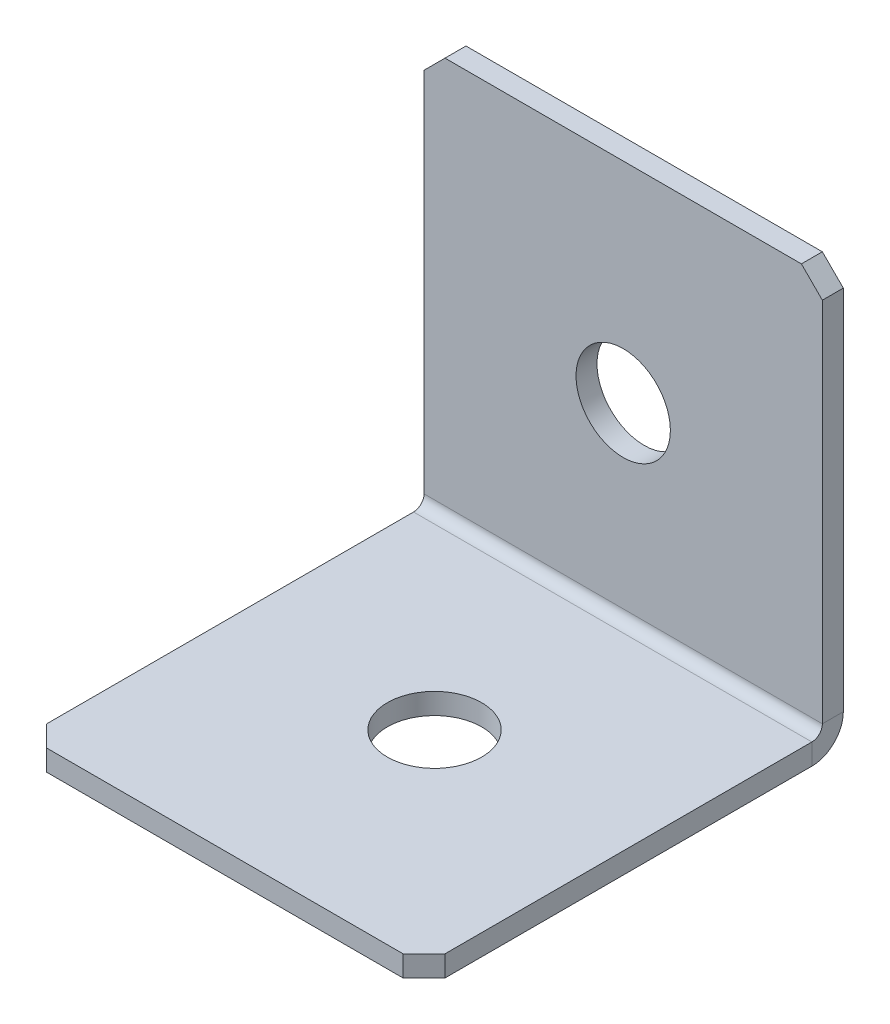
ISO-10303-21;
HEADER;
FILE_DESCRIPTION(('STEP AP214'),'2;1');
FILE_NAME('part.step','',(''),(''),'','','');
FILE_SCHEMA(('AUTOMOTIVE_DESIGN { 1 0 10303 214 1 1 1 1 }'));
ENDSEC;
DATA;
#1=APPLICATION_CONTEXT('core data for automotive mechanical design processes');
#2=APPLICATION_PROTOCOL_DEFINITION('international standard','automotive_design',2000,#1);
#3=PRODUCT_CONTEXT('',#1,'mechanical');
#4=PRODUCT('Part','Part','',(#3));
#5=PRODUCT_RELATED_PRODUCT_CATEGORY('part','',(#4));
#6=PRODUCT_DEFINITION_FORMATION('','',#4);
#7=PRODUCT_DEFINITION_CONTEXT('part definition',#1,'design');
#8=PRODUCT_DEFINITION('design','',#6,#7);
#9=PRODUCT_DEFINITION_SHAPE('','',#8);
#10=(LENGTH_UNIT() NAMED_UNIT(*) SI_UNIT(.MILLI.,.METRE.));
#11=(NAMED_UNIT(*) PLANE_ANGLE_UNIT() SI_UNIT($,.RADIAN.));
#12=(NAMED_UNIT(*) SI_UNIT($,.STERADIAN.) SOLID_ANGLE_UNIT());
#13=UNCERTAINTY_MEASURE_WITH_UNIT(LENGTH_MEASURE(1.E-05),#10,'distance_accuracy_value','');
#14=(GEOMETRIC_REPRESENTATION_CONTEXT(3) GLOBAL_UNCERTAINTY_ASSIGNED_CONTEXT((#13)) GLOBAL_UNIT_ASSIGNED_CONTEXT((#10,
#11,#12)) REPRESENTATION_CONTEXT('',''));
#15=CARTESIAN_POINT('',(0.,0.,0.));
#16=DIRECTION('',(0.,0.,1.));
#17=DIRECTION('',(1.,0.,0.));
#18=AXIS2_PLACEMENT_3D('',#15,#16,#17);
#19=CARTESIAN_POINT('',(19.,0.,2.));
#20=DIRECTION('',(-1.,0.,0.));
#21=DIRECTION('',(0.,1.,0.));
#22=AXIS2_PLACEMENT_3D('',#19,#20,#21);
#23=PLANE('',#22);
#24=DIRECTION('',(0.,1.,0.));
#25=VECTOR('',#24,1.);
#26=CARTESIAN_POINT('',(19.,0.,0.));
#27=LINE('',#26,#25);
#28=CARTESIAN_POINT('',(19.,3.,0.));
#29=VERTEX_POINT('',#28);
#30=CARTESIAN_POINT('',(19.,38.,0.));
#31=VERTEX_POINT('',#30);
#32=EDGE_CURVE('E233',#29,#31,#27,.T.);
#33=ORIENTED_EDGE('',*,*,#32,.T.);
#34=DIRECTION('',(0.,0.,-1.));
#35=VECTOR('',#34,1.);
#36=CARTESIAN_POINT('',(19.,38.,2.));
#37=LINE('',#36,#35);
#38=CARTESIAN_POINT('',(19.,38.,2.));
#39=VERTEX_POINT('',#38);
#40=EDGE_CURVE('E253',#31,#39,#37,.F.);
#41=ORIENTED_EDGE('',*,*,#40,.T.);
#42=DIRECTION('',(0.,1.,0.));
#43=VECTOR('',#42,1.);
#44=CARTESIAN_POINT('',(19.,0.,2.));
#45=LINE('',#44,#43);
#46=CARTESIAN_POINT('',(19.,3.,2.));
#47=VERTEX_POINT('',#46);
#48=EDGE_CURVE('E224',#47,#39,#45,.T.);
#49=ORIENTED_EDGE('',*,*,#48,.F.);
#50=DIRECTION('',(0.,0.,-1.));
#51=VECTOR('',#50,1.);
#52=CARTESIAN_POINT('',(19.,3.,2.));
#53=LINE('',#52,#51);
#54=EDGE_CURVE('E209',#47,#29,#53,.T.);
#55=ORIENTED_EDGE('',*,*,#54,.T.);
#56=EDGE_LOOP('',(#33,#41,#49,#55));
#57=FACE_BOUND('',#56,.T.);
#58=ADVANCED_FACE('F62',(#57),#23,.F.);
#59=CARTESIAN_POINT('',(0.,0.,2.));
#60=DIRECTION('',(0.,0.,-1.));
#61=DIRECTION('',(-1.,0.,0.));
#62=AXIS2_PLACEMENT_3D('',#59,#60,#61);
#63=PLANE('',#62);
#64=CARTESIAN_POINT('',(0.,20.,2.));
#65=DIRECTION('',(0.,0.,1.));
#66=DIRECTION('',(1.,0.,0.));
#67=AXIS2_PLACEMENT_3D('',#64,#65,#66);
#68=CIRCLE('',#67,4.5);
#69=CARTESIAN_POINT('',(4.5,20.,2.));
#70=VERTEX_POINT('',#69);
#71=EDGE_CURVE('E516',#70,#70,#68,.T.);
#72=ORIENTED_EDGE('',*,*,#71,.F.);
#73=EDGE_LOOP('',(#72));
#74=FACE_BOUND('',#73,.T.);
#75=ORIENTED_EDGE('',*,*,#48,.T.);
#76=DIRECTION('',(0.707106781186549,-0.707106781186546,0.));
#77=VECTOR('',#76,1.);
#78=CARTESIAN_POINT('',(19.,38.,2.));
#79=LINE('',#78,#77);
#80=CARTESIAN_POINT('',(17.,40.,2.));
#81=VERTEX_POINT('',#80);
#82=EDGE_CURVE('E258',#39,#81,#79,.F.);
#83=ORIENTED_EDGE('',*,*,#82,.T.);
#84=DIRECTION('',(-1.,0.,0.));
#85=VECTOR('',#84,1.);
#86=CARTESIAN_POINT('',(-19.,40.,2.));
#87=LINE('',#86,#85);
#88=CARTESIAN_POINT('',(-17.,40.,2.));
#89=VERTEX_POINT('',#88);
#90=EDGE_CURVE('E228',#81,#89,#87,.T.);
#91=ORIENTED_EDGE('',*,*,#90,.T.);
#92=DIRECTION('',(0.707106781186546,0.707106781186549,0.));
#93=VECTOR('',#92,1.);
#94=CARTESIAN_POINT('',(-17.,40.,2.));
#95=LINE('',#94,#93);
#96=CARTESIAN_POINT('',(-19.,38.,2.));
#97=VERTEX_POINT('',#96);
#98=EDGE_CURVE('E256',#89,#97,#95,.F.);
#99=ORIENTED_EDGE('',*,*,#98,.T.);
#100=DIRECTION('',(0.,-1.,0.));
#101=VECTOR('',#100,1.);
#102=CARTESIAN_POINT('',(-19.,0.,2.));
#103=LINE('',#102,#101);
#104=CARTESIAN_POINT('',(-19.,3.,2.));
#105=VERTEX_POINT('',#104);
#106=EDGE_CURVE('E222',#97,#105,#103,.T.);
#107=ORIENTED_EDGE('',*,*,#106,.T.);
#108=DIRECTION('',(1.,0.,0.));
#109=VECTOR('',#108,1.);
#110=CARTESIAN_POINT('',(19.,3.,2.));
#111=LINE('',#110,#109);
#112=EDGE_CURVE('E213',#47,#105,#111,.F.);
#113=ORIENTED_EDGE('',*,*,#112,.F.);
#114=EDGE_LOOP('',(#75,#83,#91,#99,#107,#113));
#115=FACE_BOUND('',#114,.T.);
#116=ADVANCED_FACE('F276',(#74,#115),#63,.F.);
#117=CARTESIAN_POINT('',(0.,0.,0.));
#118=DIRECTION('',(0.,0.,-1.));
#119=DIRECTION('',(-1.,0.,0.));
#120=AXIS2_PLACEMENT_3D('',#117,#118,#119);
#121=PLANE('',#120);
#122=CARTESIAN_POINT('',(0.,20.,0.));
#123=DIRECTION('',(0.,0.,-1.));
#124=DIRECTION('',(-1.,0.,0.));
#125=AXIS2_PLACEMENT_3D('',#122,#123,#124);
#126=CIRCLE('',#125,4.5);
#127=CARTESIAN_POINT('',(-4.5,20.,0.));
#128=VERTEX_POINT('',#127);
#129=EDGE_CURVE('E206',#128,#128,#126,.T.);
#130=ORIENTED_EDGE('',*,*,#129,.F.);
#131=EDGE_LOOP('',(#130));
#132=FACE_BOUND('',#131,.T.);
#133=DIRECTION('',(-1.,0.,0.));
#134=VECTOR('',#133,1.);
#135=CARTESIAN_POINT('',(0.,40.,0.));
#136=LINE('',#135,#134);
#137=CARTESIAN_POINT('',(17.,40.,0.));
#138=VERTEX_POINT('',#137);
#139=CARTESIAN_POINT('',(-17.,40.,0.));
#140=VERTEX_POINT('',#139);
#141=EDGE_CURVE('E225',#138,#140,#136,.T.);
#142=ORIENTED_EDGE('',*,*,#141,.F.);
#143=DIRECTION('',(-0.707106781186549,0.707106781186546,0.));
#144=VECTOR('',#143,1.);
#145=CARTESIAN_POINT('',(28.5,28.5000000000001,0.));
#146=LINE('',#145,#144);
#147=EDGE_CURVE('E71',#138,#31,#146,.F.);
#148=ORIENTED_EDGE('',*,*,#147,.T.);
#149=ORIENTED_EDGE('',*,*,#32,.F.);
#150=DIRECTION('',(1.,0.,0.));
#151=VECTOR('',#150,1.);
#152=CARTESIAN_POINT('',(19.,3.,0.));
#153=LINE('',#152,#151);
#154=CARTESIAN_POINT('',(-19.,3.00000000000001,0.));
#155=VERTEX_POINT('',#154);
#156=EDGE_CURVE('E160',#29,#155,#153,.F.);
#157=ORIENTED_EDGE('',*,*,#156,.T.);
#158=DIRECTION('',(0.,1.,0.));
#159=VECTOR('',#158,1.);
#160=CARTESIAN_POINT('',(-19.,0.,0.));
#161=LINE('',#160,#159);
#162=CARTESIAN_POINT('',(-19.,38.,0.));
#163=VERTEX_POINT('',#162);
#164=EDGE_CURVE('E220',#163,#155,#161,.F.);
#165=ORIENTED_EDGE('',*,*,#164,.F.);
#166=DIRECTION('',(-0.707106781186546,-0.707106781186549,0.));
#167=VECTOR('',#166,1.);
#168=CARTESIAN_POINT('',(-28.5,28.4999999999999,0.));
#169=LINE('',#168,#167);
#170=EDGE_CURVE('E83',#163,#140,#169,.F.);
#171=ORIENTED_EDGE('',*,*,#170,.T.);
#172=EDGE_LOOP('',(#142,#148,#149,#157,#165,#171));
#173=FACE_BOUND('',#172,.T.);
#174=ADVANCED_FACE('F267',(#132,#173),#121,.T.);
#175=CARTESIAN_POINT('',(-19.,40.,2.));
#176=DIRECTION('',(0.,-1.,0.));
#177=DIRECTION('',(-1.,0.,0.));
#178=AXIS2_PLACEMENT_3D('',#175,#176,#177);
#179=PLANE('',#178);
#180=ORIENTED_EDGE('',*,*,#90,.F.);
#181=DIRECTION('',(0.,0.,1.));
#182=VECTOR('',#181,1.);
#183=CARTESIAN_POINT('',(17.,40.,2.));
#184=LINE('',#183,#182);
#185=EDGE_CURVE('E263',#81,#138,#184,.F.);
#186=ORIENTED_EDGE('',*,*,#185,.T.);
#187=ORIENTED_EDGE('',*,*,#141,.T.);
#188=DIRECTION('',(0.,0.,-1.));
#189=VECTOR('',#188,1.);
#190=CARTESIAN_POINT('',(-17.,40.,2.));
#191=LINE('',#190,#189);
#192=EDGE_CURVE('E260',#140,#89,#191,.F.);
#193=ORIENTED_EDGE('',*,*,#192,.T.);
#194=EDGE_LOOP('',(#180,#186,#187,#193));
#195=FACE_BOUND('',#194,.T.);
#196=ADVANCED_FACE('F279',(#195),#179,.F.);
#197=CARTESIAN_POINT('',(-19.,0.,2.));
#198=DIRECTION('',(1.,0.,0.));
#199=DIRECTION('',(0.,-1.,0.));
#200=AXIS2_PLACEMENT_3D('',#197,#198,#199);
#201=PLANE('',#200);
#202=ORIENTED_EDGE('',*,*,#106,.F.);
#203=DIRECTION('',(0.,0.,1.));
#204=VECTOR('',#203,1.);
#205=CARTESIAN_POINT('',(-19.,38.,2.));
#206=LINE('',#205,#204);
#207=EDGE_CURVE('E13',#97,#163,#206,.F.);
#208=ORIENTED_EDGE('',*,*,#207,.T.);
#209=ORIENTED_EDGE('',*,*,#164,.T.);
#210=DIRECTION('',(0.,0.,-1.));
#211=VECTOR('',#210,1.);
#212=CARTESIAN_POINT('',(-19.,3.,2.));
#213=LINE('',#212,#211);
#214=EDGE_CURVE('E217',#105,#155,#213,.T.);
#215=ORIENTED_EDGE('',*,*,#214,.F.);
#216=EDGE_LOOP('',(#202,#208,#209,#215));
#217=FACE_BOUND('',#216,.T.);
#218=ADVANCED_FACE('F283',(#217),#201,.F.);
#219=CARTESIAN_POINT('',(-19.,3.,3.));
#220=DIRECTION('',(-1.,0.,0.));
#221=DIRECTION('',(0.,0.,1.));
#222=AXIS2_PLACEMENT_3D('',#219,#220,#221);
#223=PLANE('',#222);
#224=DIRECTION('',(0.,1.,0.));
#225=VECTOR('',#224,1.);
#226=CARTESIAN_POINT('',(-19.,0.,2.99999999999999));
#227=LINE('',#226,#225);
#228=CARTESIAN_POINT('',(-19.,2.,3.));
#229=VERTEX_POINT('',#228);
#230=CARTESIAN_POINT('',(-19.,0.,2.99999999999999));
#231=VERTEX_POINT('',#230);
#232=EDGE_CURVE('E203',#229,#231,#227,.F.);
#233=ORIENTED_EDGE('',*,*,#232,.F.);
#234=CARTESIAN_POINT('',(-19.,3.,3.));
#235=DIRECTION('',(1.,0.,0.));
#236=DIRECTION('',(0.,0.,-1.));
#237=AXIS2_PLACEMENT_3D('',#234,#235,#236);
#238=CIRCLE('',#237,1.);
#239=EDGE_CURVE('E163',#105,#229,#238,.F.);
#240=ORIENTED_EDGE('',*,*,#239,.F.);
#241=ORIENTED_EDGE('',*,*,#214,.T.);
#242=CARTESIAN_POINT('',(-19.,3.,3.));
#243=DIRECTION('',(1.,0.,0.));
#244=DIRECTION('',(0.,0.,-1.));
#245=AXIS2_PLACEMENT_3D('',#242,#243,#244);
#246=CIRCLE('',#245,3.);
#247=EDGE_CURVE('E208',#155,#231,#246,.F.);
#248=ORIENTED_EDGE('',*,*,#247,.T.);
#249=EDGE_LOOP('',(#233,#240,#241,#248));
#250=FACE_BOUND('',#249,.T.);
#251=ADVANCED_FACE('F287',(#250),#223,.T.);
#252=CARTESIAN_POINT('',(19.,3.,3.));
#253=DIRECTION('',(-1.,0.,0.));
#254=DIRECTION('',(0.,0.,1.));
#255=AXIS2_PLACEMENT_3D('',#252,#253,#254);
#256=PLANE('',#255);
#257=CARTESIAN_POINT('',(19.,3.,3.));
#258=DIRECTION('',(1.,0.,0.));
#259=DIRECTION('',(0.,0.,-1.));
#260=AXIS2_PLACEMENT_3D('',#257,#258,#259);
#261=CIRCLE('',#260,1.);
#262=CARTESIAN_POINT('',(19.,2.,3.));
#263=VERTEX_POINT('',#262);
#264=EDGE_CURVE('E170',#263,#47,#261,.T.);
#265=ORIENTED_EDGE('',*,*,#264,.F.);
#266=DIRECTION('',(0.,1.,0.));
#267=VECTOR('',#266,1.);
#268=CARTESIAN_POINT('',(19.,2.,3.));
#269=LINE('',#268,#267);
#270=CARTESIAN_POINT('',(19.,0.,2.99999999999999));
#271=VERTEX_POINT('',#270);
#272=EDGE_CURVE('E167',#263,#271,#269,.F.);
#273=ORIENTED_EDGE('',*,*,#272,.T.);
#274=CARTESIAN_POINT('',(19.,3.,3.));
#275=DIRECTION('',(1.,0.,0.));
#276=DIRECTION('',(0.,0.,-1.));
#277=AXIS2_PLACEMENT_3D('',#274,#275,#276);
#278=CIRCLE('',#277,3.);
#279=EDGE_CURVE('E152',#271,#29,#278,.T.);
#280=ORIENTED_EDGE('',*,*,#279,.T.);
#281=ORIENTED_EDGE('',*,*,#54,.F.);
#282=EDGE_LOOP('',(#265,#273,#280,#281));
#283=FACE_BOUND('',#282,.T.);
#284=ADVANCED_FACE('F168',(#283),#256,.F.);
#285=CARTESIAN_POINT('',(19.,3.,3.));
#286=DIRECTION('',(1.,0.,0.));
#287=DIRECTION('',(0.,-1.,0.));
#288=AXIS2_PLACEMENT_3D('',#285,#286,#287);
#289=CYLINDRICAL_SURFACE('',#288,3.);
#290=ORIENTED_EDGE('',*,*,#156,.F.);
#291=ORIENTED_EDGE('',*,*,#279,.F.);
#292=DIRECTION('',(1.,0.,0.));
#293=VECTOR('',#292,1.);
#294=CARTESIAN_POINT('',(-19.,0.,2.99999999999999));
#295=LINE('',#294,#293);
#296=EDGE_CURVE('E157',#271,#231,#295,.F.);
#297=ORIENTED_EDGE('',*,*,#296,.T.);
#298=ORIENTED_EDGE('',*,*,#247,.F.);
#299=EDGE_LOOP('',(#290,#291,#297,#298));
#300=FACE_BOUND('',#299,.T.);
#301=ADVANCED_FACE('F154',(#300),#289,.T.);
#302=CARTESIAN_POINT('',(19.,3.,3.));
#303=DIRECTION('',(1.,0.,0.));
#304=DIRECTION('',(0.,-1.,0.));
#305=AXIS2_PLACEMENT_3D('',#302,#303,#304);
#306=CYLINDRICAL_SURFACE('',#305,1.);
#307=ORIENTED_EDGE('',*,*,#112,.T.);
#308=ORIENTED_EDGE('',*,*,#239,.T.);
#309=DIRECTION('',(1.,0.,0.));
#310=VECTOR('',#309,1.);
#311=CARTESIAN_POINT('',(-19.,2.,3.));
#312=LINE('',#311,#310);
#313=EDGE_CURVE('E175',#229,#263,#312,.T.);
#314=ORIENTED_EDGE('',*,*,#313,.T.);
#315=ORIENTED_EDGE('',*,*,#264,.T.);
#316=EDGE_LOOP('',(#307,#308,#314,#315));
#317=FACE_BOUND('',#316,.T.);
#318=ADVANCED_FACE('F290',(#317),#306,.F.);
#319=CARTESIAN_POINT('',(-19.,0.,1.99999999999999));
#320=DIRECTION('',(1.,0.,0.));
#321=DIRECTION('',(0.,0.,-1.));
#322=AXIS2_PLACEMENT_3D('',#319,#320,#321);
#323=PLANE('',#322);
#324=DIRECTION('',(0.,0.,-1.));
#325=VECTOR('',#324,1.);
#326=CARTESIAN_POINT('',(-19.,0.,0.));
#327=LINE('',#326,#325);
#328=CARTESIAN_POINT('',(-19.,-1.25737396972132E-13,38.));
#329=VERTEX_POINT('',#328);
#330=EDGE_CURVE('E183',#329,#231,#327,.T.);
#331=ORIENTED_EDGE('',*,*,#330,.F.);
#332=DIRECTION('',(0.,1.,0.));
#333=VECTOR('',#332,1.);
#334=CARTESIAN_POINT('',(-19.,-1.25693328198353E-13,38.));
#335=LINE('',#334,#333);
#336=CARTESIAN_POINT('',(-19.,1.99999999999987,38.));
#337=VERTEX_POINT('',#336);
#338=EDGE_CURVE('E250',#329,#337,#335,.T.);
#339=ORIENTED_EDGE('',*,*,#338,.T.);
#340=DIRECTION('',(0.,0.,1.));
#341=VECTOR('',#340,1.);
#342=CARTESIAN_POINT('',(-19.,2.,2.));
#343=LINE('',#342,#341);
#344=EDGE_CURVE('E184',#337,#229,#343,.F.);
#345=ORIENTED_EDGE('',*,*,#344,.T.);
#346=ORIENTED_EDGE('',*,*,#232,.T.);
#347=EDGE_LOOP('',(#331,#339,#345,#346));
#348=FACE_BOUND('',#347,.T.);
#349=ADVANCED_FACE('F307',(#348),#323,.F.);
#350=CARTESIAN_POINT('',(19.,-1.32706345912226E-13,40.));
#351=DIRECTION('',(-1.,0.,0.));
#352=DIRECTION('',(0.,0.,1.));
#353=AXIS2_PLACEMENT_3D('',#350,#351,#352);
#354=PLANE('',#353);
#355=DIRECTION('',(0.,0.,-1.));
#356=VECTOR('',#355,1.);
#357=CARTESIAN_POINT('',(19.,1.99999999999987,40.));
#358=LINE('',#357,#356);
#359=CARTESIAN_POINT('',(19.,1.99999999999987,38.));
#360=VERTEX_POINT('',#359);
#361=EDGE_CURVE('E199',#263,#360,#358,.F.);
#362=ORIENTED_EDGE('',*,*,#361,.T.);
#363=DIRECTION('',(0.,-1.,0.));
#364=VECTOR('',#363,1.);
#365=CARTESIAN_POINT('',(19.,-1.25723383234539E-13,38.));
#366=LINE('',#365,#364);
#367=CARTESIAN_POINT('',(19.,-1.25737396972132E-13,38.));
#368=VERTEX_POINT('',#367);
#369=EDGE_CURVE('E188',#360,#368,#366,.T.);
#370=ORIENTED_EDGE('',*,*,#369,.T.);
#371=DIRECTION('',(0.,0.,1.));
#372=VECTOR('',#371,1.);
#373=CARTESIAN_POINT('',(19.,0.,0.));
#374=LINE('',#373,#372);
#375=EDGE_CURVE('E180',#271,#368,#374,.T.);
#376=ORIENTED_EDGE('',*,*,#375,.F.);
#377=ORIENTED_EDGE('',*,*,#272,.F.);
#378=EDGE_LOOP('',(#362,#370,#376,#377));
#379=FACE_BOUND('',#378,.T.);
#380=ADVANCED_FACE('F186',(#379),#354,.F.);
#381=CARTESIAN_POINT('',(0.,0.,0.));
#382=DIRECTION('',(0.,1.,0.));
#383=DIRECTION('',(0.,0.,1.));
#384=AXIS2_PLACEMENT_3D('',#381,#382,#383);
#385=PLANE('',#384);
#386=CARTESIAN_POINT('',(0.,0.,20.));
#387=DIRECTION('',(0.,1.,0.));
#388=DIRECTION('',(0.,0.,1.));
#389=AXIS2_PLACEMENT_3D('',#386,#387,#388);
#390=CIRCLE('',#389,4.5);
#391=CARTESIAN_POINT('',(0.,0.,24.5));
#392=VERTEX_POINT('',#391);
#393=EDGE_CURVE('E519',#392,#392,#390,.T.);
#394=ORIENTED_EDGE('',*,*,#393,.T.);
#395=EDGE_LOOP('',(#394));
#396=FACE_BOUND('',#395,.T.);
#397=ORIENTED_EDGE('',*,*,#375,.T.);
#398=DIRECTION('',(0.707106781186547,0.,-0.707106781186548));
#399=VECTOR('',#398,1.);
#400=CARTESIAN_POINT('',(17.,-1.32706345912226E-13,40.));
#401=LINE('',#400,#399);
#402=CARTESIAN_POINT('',(17.,-1.32720359649818E-13,40.));
#403=VERTEX_POINT('',#402);
#404=EDGE_CURVE('E248',#368,#403,#401,.F.);
#405=ORIENTED_EDGE('',*,*,#404,.T.);
#406=DIRECTION('',(-1.,0.,0.));
#407=VECTOR('',#406,1.);
#408=CARTESIAN_POINT('',(0.,-1.32720359649818E-13,40.));
#409=LINE('',#408,#407);
#410=CARTESIAN_POINT('',(-17.,-1.32720359649818E-13,40.));
#411=VERTEX_POINT('',#410);
#412=EDGE_CURVE('E189',#403,#411,#409,.T.);
#413=ORIENTED_EDGE('',*,*,#412,.T.);
#414=DIRECTION('',(0.70710678118655,0.,0.707106781186545));
#415=VECTOR('',#414,1.);
#416=CARTESIAN_POINT('',(-19.,-1.25693328198353E-13,38.));
#417=LINE('',#416,#415);
#418=EDGE_CURVE('E246',#411,#329,#417,.F.);
#419=ORIENTED_EDGE('',*,*,#418,.T.);
#420=ORIENTED_EDGE('',*,*,#330,.T.);
#421=ORIENTED_EDGE('',*,*,#296,.F.);
#422=EDGE_LOOP('',(#397,#405,#413,#419,#420,#421));
#423=FACE_BOUND('',#422,.T.);
#424=ADVANCED_FACE('F179',(#396,#423),#385,.F.);
#425=CARTESIAN_POINT('',(0.,2.00000000000001,0.));
#426=DIRECTION('',(0.,1.,0.));
#427=DIRECTION('',(0.,0.,1.));
#428=AXIS2_PLACEMENT_3D('',#425,#426,#427);
#429=PLANE('',#428);
#430=CARTESIAN_POINT('',(0.,1.99999999999994,20.));
#431=DIRECTION('',(0.,1.,0.));
#432=DIRECTION('',(0.,0.,1.));
#433=AXIS2_PLACEMENT_3D('',#430,#431,#432);
#434=CIRCLE('',#433,4.5);
#435=CARTESIAN_POINT('',(0.,1.99999999999992,24.5));
#436=VERTEX_POINT('',#435);
#437=EDGE_CURVE('E524',#436,#436,#434,.T.);
#438=ORIENTED_EDGE('',*,*,#437,.F.);
#439=EDGE_LOOP('',(#438));
#440=FACE_BOUND('',#439,.T.);
#441=DIRECTION('',(1.,0.,0.));
#442=VECTOR('',#441,1.);
#443=CARTESIAN_POINT('',(-19.,1.99999999999987,40.));
#444=LINE('',#443,#442);
#445=CARTESIAN_POINT('',(17.,1.99999999999987,40.));
#446=VERTEX_POINT('',#445);
#447=CARTESIAN_POINT('',(-17.,1.99999999999987,40.));
#448=VERTEX_POINT('',#447);
#449=EDGE_CURVE('E193',#446,#448,#444,.F.);
#450=ORIENTED_EDGE('',*,*,#449,.F.);
#451=DIRECTION('',(-0.707106781186547,0.,0.707106781186548));
#452=VECTOR('',#451,1.);
#453=CARTESIAN_POINT('',(28.5,1.99999999999991,28.5));
#454=LINE('',#453,#452);
#455=EDGE_CURVE('E243',#446,#360,#454,.F.);
#456=ORIENTED_EDGE('',*,*,#455,.T.);
#457=ORIENTED_EDGE('',*,*,#361,.F.);
#458=ORIENTED_EDGE('',*,*,#313,.F.);
#459=ORIENTED_EDGE('',*,*,#344,.F.);
#460=DIRECTION('',(-0.70710678118655,0.,-0.707106781186545));
#461=VECTOR('',#460,1.);
#462=CARTESIAN_POINT('',(-28.4999999999999,1.99999999999991,28.5000000000001));
#463=LINE('',#462,#461);
#464=EDGE_CURVE('E241',#337,#448,#463,.F.);
#465=ORIENTED_EDGE('',*,*,#464,.T.);
#466=EDGE_LOOP('',(#450,#456,#457,#458,#459,#465));
#467=FACE_BOUND('',#466,.T.);
#468=ADVANCED_FACE('F294',(#440,#467),#429,.T.);
#469=CARTESIAN_POINT('',(-19.,-1.32706345912226E-13,40.));
#470=DIRECTION('',(0.,0.,-1.));
#471=DIRECTION('',(0.,1.,0.));
#472=AXIS2_PLACEMENT_3D('',#469,#470,#471);
#473=PLANE('',#472);
#474=ORIENTED_EDGE('',*,*,#412,.F.);
#475=DIRECTION('',(0.,1.,0.));
#476=VECTOR('',#475,1.);
#477=CARTESIAN_POINT('',(17.,-1.32706345912226E-13,40.));
#478=LINE('',#477,#476);
#479=EDGE_CURVE('E238',#403,#446,#478,.T.);
#480=ORIENTED_EDGE('',*,*,#479,.T.);
#481=ORIENTED_EDGE('',*,*,#449,.T.);
#482=DIRECTION('',(0.,-1.,0.));
#483=VECTOR('',#482,1.);
#484=CARTESIAN_POINT('',(-17.,-1.32706345912226E-13,40.));
#485=LINE('',#484,#483);
#486=EDGE_CURVE('E231',#448,#411,#485,.T.);
#487=ORIENTED_EDGE('',*,*,#486,.T.);
#488=EDGE_LOOP('',(#474,#480,#481,#487));
#489=FACE_BOUND('',#488,.T.);
#490=ADVANCED_FACE('F301',(#489),#473,.F.);
#491=CARTESIAN_POINT('',(0.,20.,2.));
#492=DIRECTION('',(0.,0.,1.));
#493=DIRECTION('',(1.,0.,0.));
#494=AXIS2_PLACEMENT_3D('',#491,#492,#493);
#495=CYLINDRICAL_SURFACE('',#494,4.5);
#496=ORIENTED_EDGE('',*,*,#71,.T.);
#497=EDGE_LOOP('',(#496));
#498=FACE_BOUND('',#497,.T.);
#499=ORIENTED_EDGE('',*,*,#129,.T.);
#500=EDGE_LOOP('',(#499));
#501=FACE_BOUND('',#500,.T.);
#502=ADVANCED_FACE('F373',(#498,#501),#495,.F.);
#503=CARTESIAN_POINT('',(0.,1.99999999999994,20.));
#504=DIRECTION('',(0.,1.,0.));
#505=DIRECTION('',(0.,0.,1.));
#506=AXIS2_PLACEMENT_3D('',#503,#504,#505);
#507=CYLINDRICAL_SURFACE('',#506,4.5);
#508=ORIENTED_EDGE('',*,*,#393,.F.);
#509=EDGE_LOOP('',(#508));
#510=FACE_BOUND('',#509,.T.);
#511=ORIENTED_EDGE('',*,*,#437,.T.);
#512=EDGE_LOOP('',(#511));
#513=FACE_BOUND('',#512,.T.);
#514=ADVANCED_FACE('F333',(#510,#513),#507,.F.);
#515=CARTESIAN_POINT('',(17.,-1.32706345912226E-13,40.));
#516=DIRECTION('',(-0.707106781186548,0.,-0.707106781186547));
#517=DIRECTION('',(0.,1.,0.));
#518=AXIS2_PLACEMENT_3D('',#515,#516,#517);
#519=PLANE('',#518);
#520=ORIENTED_EDGE('',*,*,#404,.F.);
#521=ORIENTED_EDGE('',*,*,#369,.F.);
#522=ORIENTED_EDGE('',*,*,#455,.F.);
#523=ORIENTED_EDGE('',*,*,#479,.F.);
#524=EDGE_LOOP('',(#520,#521,#522,#523));
#525=FACE_BOUND('',#524,.T.);
#526=ADVANCED_FACE('F296',(#525),#519,.F.);
#527=CARTESIAN_POINT('',(-19.,-1.25693328198353E-13,38.));
#528=DIRECTION('',(0.707106781186545,0.,-0.70710678118655));
#529=DIRECTION('',(0.,1.,0.));
#530=AXIS2_PLACEMENT_3D('',#527,#528,#529);
#531=PLANE('',#530);
#532=ORIENTED_EDGE('',*,*,#418,.F.);
#533=ORIENTED_EDGE('',*,*,#486,.F.);
#534=ORIENTED_EDGE('',*,*,#464,.F.);
#535=ORIENTED_EDGE('',*,*,#338,.F.);
#536=EDGE_LOOP('',(#532,#533,#534,#535));
#537=FACE_BOUND('',#536,.T.);
#538=ADVANCED_FACE('F304',(#537),#531,.F.);
#539=CARTESIAN_POINT('',(19.,38.,2.));
#540=DIRECTION('',(-0.707106781186546,-0.707106781186549,0.));
#541=DIRECTION('',(0.,0.,1.));
#542=AXIS2_PLACEMENT_3D('',#539,#540,#541);
#543=PLANE('',#542);
#544=ORIENTED_EDGE('',*,*,#147,.F.);
#545=ORIENTED_EDGE('',*,*,#185,.F.);
#546=ORIENTED_EDGE('',*,*,#82,.F.);
#547=ORIENTED_EDGE('',*,*,#40,.F.);
#548=EDGE_LOOP('',(#544,#545,#546,#547));
#549=FACE_BOUND('',#548,.T.);
#550=ADVANCED_FACE('F273',(#549),#543,.F.);
#551=CARTESIAN_POINT('',(-17.,40.,2.));
#552=DIRECTION('',(0.707106781186549,-0.707106781186546,0.));
#553=DIRECTION('',(0.,0.,1.));
#554=AXIS2_PLACEMENT_3D('',#551,#552,#553);
#555=PLANE('',#554);
#556=ORIENTED_EDGE('',*,*,#170,.F.);
#557=ORIENTED_EDGE('',*,*,#207,.F.);
#558=ORIENTED_EDGE('',*,*,#98,.F.);
#559=ORIENTED_EDGE('',*,*,#192,.F.);
#560=EDGE_LOOP('',(#556,#557,#558,#559));
#561=FACE_BOUND('',#560,.T.);
#562=ADVANCED_FACE('F65',(#561),#555,.F.);
#563=CLOSED_SHELL('',(#58,#116,#174,#196,#218,#251,#284,#301,#318,#349,#380,#424,#468,#490,#502,
#514,#526,#538,#550,#562));
#564=MANIFOLD_SOLID_BREP('B2',#563);
#565=ADVANCED_BREP_SHAPE_REPRESENTATION('',(#18,#564),#14);
#566=SHAPE_DEFINITION_REPRESENTATION(#9,#565);
ENDSEC;
END-ISO-10303-21;
